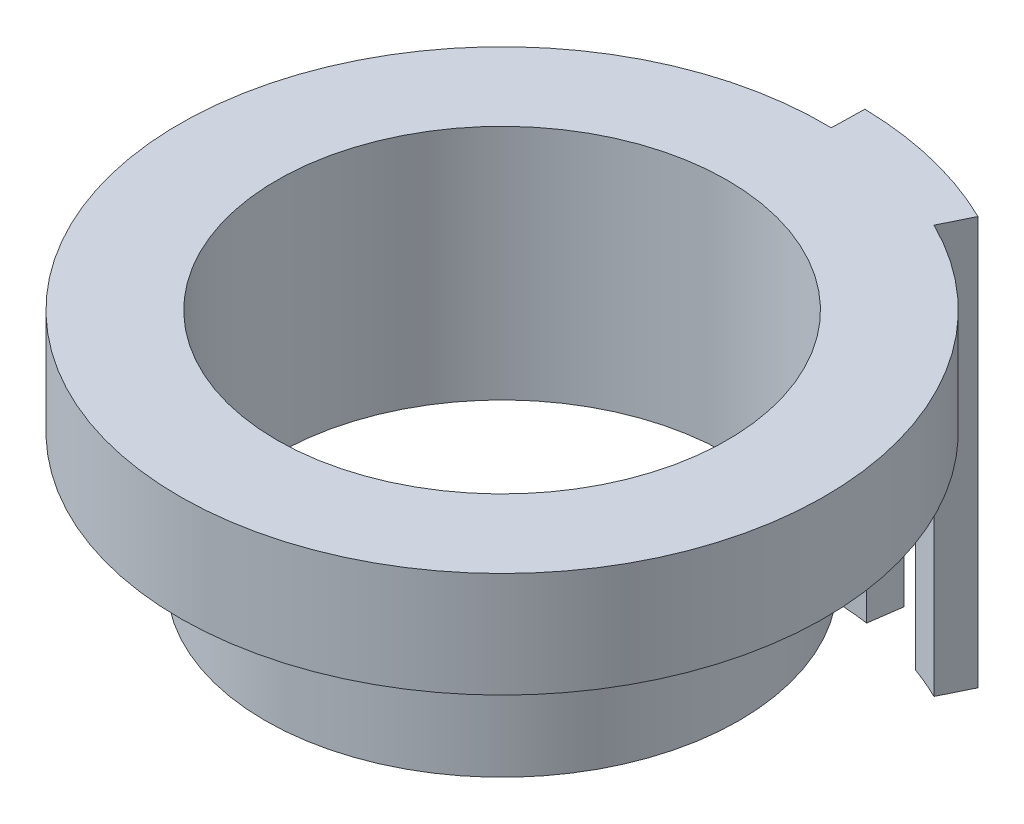
ISO-10303-21;
HEADER;
FILE_DESCRIPTION(('STEP AP214'),'2;1');
FILE_NAME('part.step','',(''),(''),'','','');
FILE_SCHEMA(('AUTOMOTIVE_DESIGN { 1 0 10303 214 1 1 1 1 }'));
ENDSEC;
DATA;
#1=APPLICATION_CONTEXT('core data for automotive mechanical design processes');
#2=APPLICATION_PROTOCOL_DEFINITION('international standard','automotive_design',2000,#1);
#3=PRODUCT_CONTEXT('',#1,'mechanical');
#4=PRODUCT('Part','Part','',(#3));
#5=PRODUCT_RELATED_PRODUCT_CATEGORY('part','',(#4));
#6=PRODUCT_DEFINITION_FORMATION('','',#4);
#7=PRODUCT_DEFINITION_CONTEXT('part definition',#1,'design');
#8=PRODUCT_DEFINITION('design','',#6,#7);
#9=PRODUCT_DEFINITION_SHAPE('','',#8);
#10=(LENGTH_UNIT() NAMED_UNIT(*) SI_UNIT(.MILLI.,.METRE.));
#11=(NAMED_UNIT(*) PLANE_ANGLE_UNIT() SI_UNIT($,.RADIAN.));
#12=(NAMED_UNIT(*) SI_UNIT($,.STERADIAN.) SOLID_ANGLE_UNIT());
#13=UNCERTAINTY_MEASURE_WITH_UNIT(LENGTH_MEASURE(1.E-05),#10,'distance_accuracy_value','');
#14=(GEOMETRIC_REPRESENTATION_CONTEXT(3) GLOBAL_UNCERTAINTY_ASSIGNED_CONTEXT((#13)) GLOBAL_UNIT_ASSIGNED_CONTEXT((#10,
#11,#12)) REPRESENTATION_CONTEXT('',''));
#15=CARTESIAN_POINT('',(0.,0.,0.));
#16=DIRECTION('',(0.,0.,1.));
#17=DIRECTION('',(1.,0.,0.));
#18=AXIS2_PLACEMENT_3D('',#15,#16,#17);
#19=CARTESIAN_POINT('',(0.,8.,0.));
#20=DIRECTION('',(0.,-1.,0.));
#21=DIRECTION('',(0.,0.,-1.));
#22=AXIS2_PLACEMENT_3D('',#19,#20,#21);
#23=CYLINDRICAL_SURFACE('',#22,24.5);
#24=DIRECTION('',(0.,1.,0.));
#25=VECTOR('',#24,1.);
#26=CARTESIAN_POINT('',(8.39662069758259,-23.,-23.0162282066573));
#27=LINE('',#26,#25);
#28=CARTESIAN_POINT('',(8.39662069758259,0.,-23.0162282066573));
#29=VERTEX_POINT('',#28);
#30=CARTESIAN_POINT('',(8.39662069758259,4.,-23.0162282066573));
#31=VERTEX_POINT('',#30);
#32=EDGE_CURVE('E155',#29,#31,#27,.T.);
#33=ORIENTED_EDGE('',*,*,#32,.F.);
#34=CARTESIAN_POINT('',(0.,0.,0.));
#35=DIRECTION('',(0.,1.,0.));
#36=DIRECTION('',(0.,0.,1.));
#37=AXIS2_PLACEMENT_3D('',#34,#35,#36);
#38=CIRCLE('',#37,24.5);
#39=CARTESIAN_POINT('',(3.42779146691868,0.,-24.2590240046734));
#40=VERTEX_POINT('',#39);
#41=EDGE_CURVE('E231',#29,#40,#38,.T.);
#42=ORIENTED_EDGE('',*,*,#41,.T.);
#43=DIRECTION('',(0.,1.,0.));
#44=VECTOR('',#43,1.);
#45=CARTESIAN_POINT('',(3.42779146691868,-23.,-24.2590240046734));
#46=LINE('',#45,#44);
#47=CARTESIAN_POINT('',(3.42779146691868,4.,-24.2590240046734));
#48=VERTEX_POINT('',#47);
#49=EDGE_CURVE('E189',#40,#48,#46,.T.);
#50=ORIENTED_EDGE('',*,*,#49,.T.);
#51=CARTESIAN_POINT('',(0.,4.,0.));
#52=DIRECTION('',(0.,-1.,0.));
#53=DIRECTION('',(0.,0.,-1.));
#54=AXIS2_PLACEMENT_3D('',#51,#52,#53);
#55=CIRCLE('',#54,24.5);
#56=EDGE_CURVE('E198',#48,#31,#55,.T.);
#57=ORIENTED_EDGE('',*,*,#56,.T.);
#58=EDGE_LOOP('',(#33,#42,#50,#57));
#59=FACE_BOUND('',#58,.T.);
#60=ADVANCED_FACE('F47',(#59),#23,.T.);
#61=CARTESIAN_POINT('',(0.506368993526455,0.,-24.4947665929356));
#62=VERTEX_POINT('',#61);
#63=CARTESIAN_POINT('',(10.8108618411976,0.,-21.9857969209792));
#64=VERTEX_POINT('',#63);
#65=EDGE_CURVE('E241',#62,#64,#38,.T.);
#66=ORIENTED_EDGE('',*,*,#65,.T.);
#67=DIRECTION('',(0.,1.,0.));
#68=VECTOR('',#67,1.);
#69=CARTESIAN_POINT('',(10.8108618411976,4.,-21.9857969209792));
#70=LINE('',#69,#68);
#71=CARTESIAN_POINT('',(10.8108618411976,8.,-21.9857969209792));
#72=VERTEX_POINT('',#71);
#73=EDGE_CURVE('E214',#64,#72,#70,.T.);
#74=ORIENTED_EDGE('',*,*,#73,.T.);
#75=CARTESIAN_POINT('',(0.,8.,0.));
#76=DIRECTION('',(0.,1.,0.));
#77=DIRECTION('',(0.,0.,1.));
#78=AXIS2_PLACEMENT_3D('',#75,#76,#77);
#79=CIRCLE('',#78,24.5);
#80=CARTESIAN_POINT('',(0.506368993526455,8.,-24.4947665929356));
#81=VERTEX_POINT('',#80);
#82=EDGE_CURVE('E11',#81,#72,#79,.T.);
#83=ORIENTED_EDGE('',*,*,#82,.F.);
#84=DIRECTION('',(0.,1.,0.));
#85=VECTOR('',#84,1.);
#86=CARTESIAN_POINT('',(0.506368993526455,4.,-24.4947665929356));
#87=LINE('',#86,#85);
#88=EDGE_CURVE('E218',#62,#81,#87,.T.);
#89=ORIENTED_EDGE('',*,*,#88,.F.);
#90=EDGE_LOOP('',(#66,#74,#83,#89));
#91=FACE_BOUND('',#90,.T.);
#92=ADVANCED_FACE('F263',(#91),#23,.T.);
#93=CARTESIAN_POINT('',(0.,4.,0.));
#94=DIRECTION('',(0.,-1.,0.));
#95=DIRECTION('',(0.,0.,-1.));
#96=AXIS2_PLACEMENT_3D('',#93,#94,#95);
#97=PLANE('',#96);
#98=CARTESIAN_POINT('',(0.,4.,0.));
#99=DIRECTION('',(0.,1.,0.));
#100=DIRECTION('',(0.,0.,-1.));
#101=AXIS2_PLACEMENT_3D('',#98,#99,#100);
#102=CIRCLE('',#101,27.);
#103=CARTESIAN_POINT('',(9.25341872794816,4.,-25.3648229216223));
#104=VERTEX_POINT('',#103);
#105=CARTESIAN_POINT('',(3.77756610640018,4.,-26.7344346173952));
#106=VERTEX_POINT('',#105);
#107=EDGE_CURVE('E195',#104,#106,#102,.T.);
#108=ORIENTED_EDGE('',*,*,#107,.F.);
#109=DIRECTION('',(0.342719212146228,0.,-0.939437885986013));
#110=VECTOR('',#109,1.);
#111=CARTESIAN_POINT('',(0.,4.,0.));
#112=LINE('',#111,#110);
#113=EDGE_CURVE('E149',#31,#104,#112,.T.);
#114=ORIENTED_EDGE('',*,*,#113,.F.);
#115=ORIENTED_EDGE('',*,*,#56,.F.);
#116=DIRECTION('',(0.1399098557926,0.,-0.99016424508871));
#117=VECTOR('',#116,1.);
#118=CARTESIAN_POINT('',(0.,4.,0.));
#119=LINE('',#118,#117);
#120=EDGE_CURVE('E159',#48,#106,#119,.T.);
#121=ORIENTED_EDGE('',*,*,#120,.T.);
#122=EDGE_LOOP('',(#108,#114,#115,#121));
#123=FACE_BOUND('',#122,.T.);
#124=ADVANCED_FACE('F276',(#123),#97,.T.);
#125=CARTESIAN_POINT('',(0.,8.,0.));
#126=DIRECTION('',(0.,-1.,0.));
#127=DIRECTION('',(0.,0.,-1.));
#128=AXIS2_PLACEMENT_3D('',#125,#126,#127);
#129=CYLINDRICAL_SURFACE('',#128,17.1);
#130=CARTESIAN_POINT('',(0.,8.,0.));
#131=DIRECTION('',(0.,1.,0.));
#132=DIRECTION('',(0.,0.,1.));
#133=AXIS2_PLACEMENT_3D('',#130,#131,#132);
#134=CIRCLE('',#133,17.1);
#135=CARTESIAN_POINT('',(0.,8.,17.1));
#136=VERTEX_POINT('',#135);
#137=EDGE_CURVE('E57',#136,#136,#134,.T.);
#138=ORIENTED_EDGE('',*,*,#137,.T.);
#139=EDGE_LOOP('',(#138));
#140=FACE_BOUND('',#139,.T.);
#141=CARTESIAN_POINT('',(0.,-10.,0.));
#142=DIRECTION('',(0.,1.,0.));
#143=DIRECTION('',(0.,0.,1.));
#144=AXIS2_PLACEMENT_3D('',#141,#142,#143);
#145=CIRCLE('',#144,17.1);
#146=CARTESIAN_POINT('',(0.,-10.,17.1));
#147=VERTEX_POINT('',#146);
#148=EDGE_CURVE('E223',#147,#147,#145,.T.);
#149=ORIENTED_EDGE('',*,*,#148,.F.);
#150=EDGE_LOOP('',(#149));
#151=FACE_BOUND('',#150,.T.);
#152=ADVANCED_FACE('F49',(#140,#151),#129,.F.);
#153=CARTESIAN_POINT('',(0.,8.,0.));
#154=DIRECTION('',(0.,1.,0.));
#155=DIRECTION('',(0.,0.,1.));
#156=AXIS2_PLACEMENT_3D('',#153,#154,#155);
#157=PLANE('',#156);
#158=ORIENTED_EDGE('',*,*,#137,.F.);
#159=EDGE_LOOP('',(#158));
#160=FACE_BOUND('',#159,.T.);
#161=ORIENTED_EDGE('',*,*,#82,.T.);
#162=DIRECTION('',(0.441259666987657,0.,-0.897379466162416));
#163=VECTOR('',#162,1.);
#164=CARTESIAN_POINT('',(11.9140110086667,8.,-24.2292455863852));
#165=LINE('',#164,#163);
#166=CARTESIAN_POINT('',(11.9140110086667,8.,-24.2292455863852));
#167=VERTEX_POINT('',#166);
#168=EDGE_CURVE('E199',#72,#167,#165,.T.);
#169=ORIENTED_EDGE('',*,*,#168,.T.);
#170=CARTESIAN_POINT('',(0.,8.,0.));
#171=DIRECTION('',(0.,1.,0.));
#172=DIRECTION('',(0.,0.,-1.));
#173=AXIS2_PLACEMENT_3D('',#170,#171,#172);
#174=CIRCLE('',#173,27.);
#175=CARTESIAN_POINT('',(0.558039298988338,8.,-26.9942325718066));
#176=VERTEX_POINT('',#175);
#177=EDGE_CURVE('E194',#167,#176,#174,.T.);
#178=ORIENTED_EDGE('',*,*,#177,.T.);
#179=DIRECTION('',(-0.0206681221847532,0.,0.999786391548393));
#180=VECTOR('',#179,1.);
#181=CARTESIAN_POINT('',(0.558039298988338,8.,-26.9942325718066));
#182=LINE('',#181,#180);
#183=EDGE_CURVE('E63',#176,#81,#182,.T.);
#184=ORIENTED_EDGE('',*,*,#183,.T.);
#185=EDGE_LOOP('',(#161,#169,#178,#184));
#186=FACE_BOUND('',#185,.T.);
#187=ADVANCED_FACE('F288',(#160,#186),#157,.T.);
#188=CARTESIAN_POINT('',(0.,0.,0.));
#189=DIRECTION('',(0.,1.,0.));
#190=DIRECTION('',(0.,0.,1.));
#191=AXIS2_PLACEMENT_3D('',#188,#189,#190);
#192=PLANE('',#191);
#193=CARTESIAN_POINT('',(0.,0.,0.));
#194=DIRECTION('',(0.,1.,0.));
#195=DIRECTION('',(0.,0.,1.));
#196=AXIS2_PLACEMENT_3D('',#193,#194,#195);
#197=CIRCLE('',#196,18.);
#198=CARTESIAN_POINT('',(0.,0.,18.));
#199=VERTEX_POINT('',#198);
#200=EDGE_CURVE('E213',#199,#199,#197,.T.);
#201=ORIENTED_EDGE('',*,*,#200,.T.);
#202=EDGE_LOOP('',(#201));
#203=FACE_BOUND('',#202,.T.);
#204=EDGE_CURVE('E51',#40,#62,#38,.T.);
#205=ORIENTED_EDGE('',*,*,#204,.F.);
#206=ORIENTED_EDGE('',*,*,#41,.F.);
#207=CARTESIAN_POINT('',(0.,0.,0.));
#208=DIRECTION('',(0.,1.,0.));
#209=DIRECTION('',(0.,0.,1.));
#210=AXIS2_PLACEMENT_3D('',#207,#208,#209);
#211=CIRCLE('',#210,24.5);
#212=EDGE_CURVE('E153',#64,#29,#211,.T.);
#213=ORIENTED_EDGE('',*,*,#212,.F.);
#214=ORIENTED_EDGE('',*,*,#65,.F.);
#215=EDGE_LOOP('',(#205,#206,#213,#214));
#216=FACE_BOUND('',#215,.T.);
#217=ADVANCED_FACE('F261',(#203,#216),#192,.F.);
#218=CARTESIAN_POINT('',(0.,-10.,0.));
#219=DIRECTION('',(0.,1.,0.));
#220=DIRECTION('',(0.,0.,1.));
#221=AXIS2_PLACEMENT_3D('',#218,#219,#220);
#222=CYLINDRICAL_SURFACE('',#221,18.);
#223=CARTESIAN_POINT('',(0.,-10.,0.));
#224=DIRECTION('',(0.,1.,0.));
#225=DIRECTION('',(0.,0.,1.));
#226=AXIS2_PLACEMENT_3D('',#223,#224,#225);
#227=CIRCLE('',#226,18.);
#228=CARTESIAN_POINT('',(0.,-10.,18.));
#229=VERTEX_POINT('',#228);
#230=EDGE_CURVE('E227',#229,#229,#227,.T.);
#231=ORIENTED_EDGE('',*,*,#230,.T.);
#232=EDGE_LOOP('',(#231));
#233=FACE_BOUND('',#232,.T.);
#234=ORIENTED_EDGE('',*,*,#200,.F.);
#235=EDGE_LOOP('',(#234));
#236=FACE_BOUND('',#235,.T.);
#237=ADVANCED_FACE('F297',(#233,#236),#222,.T.);
#238=CARTESIAN_POINT('',(0.,-10.,0.));
#239=DIRECTION('',(0.,1.,0.));
#240=DIRECTION('',(0.,0.,1.));
#241=AXIS2_PLACEMENT_3D('',#238,#239,#240);
#242=PLANE('',#241);
#243=ORIENTED_EDGE('',*,*,#148,.T.);
#244=EDGE_LOOP('',(#243));
#245=FACE_BOUND('',#244,.T.);
#246=ORIENTED_EDGE('',*,*,#230,.F.);
#247=EDGE_LOOP('',(#246));
#248=FACE_BOUND('',#247,.T.);
#249=ADVANCED_FACE('F320',(#245,#248),#242,.F.);
#250=CARTESIAN_POINT('',(0.,4.,0.));
#251=DIRECTION('',(0.,1.,0.));
#252=DIRECTION('',(0.,0.,1.));
#253=AXIS2_PLACEMENT_3D('',#250,#251,#252);
#254=CYLINDRICAL_SURFACE('',#253,27.);
#255=ORIENTED_EDGE('',*,*,#177,.F.);
#256=DIRECTION('',(0.,1.,0.));
#257=VECTOR('',#256,1.);
#258=CARTESIAN_POINT('',(11.9140110086667,4.,-24.2292455863852));
#259=LINE('',#258,#257);
#260=CARTESIAN_POINT('',(11.9140110086667,-23.,-24.2292455863852));
#261=VERTEX_POINT('',#260);
#262=EDGE_CURVE('E71',#261,#167,#259,.T.);
#263=ORIENTED_EDGE('',*,*,#262,.F.);
#264=CARTESIAN_POINT('',(0.,-23.,0.));
#265=DIRECTION('',(0.,-1.,0.));
#266=DIRECTION('',(0.,0.,-1.));
#267=AXIS2_PLACEMENT_3D('',#264,#265,#266);
#268=CIRCLE('',#267,27.);
#269=CARTESIAN_POINT('',(9.25341872794816,-23.,-25.3648229216223));
#270=VERTEX_POINT('',#269);
#271=EDGE_CURVE('E139',#270,#261,#268,.T.);
#272=ORIENTED_EDGE('',*,*,#271,.F.);
#273=DIRECTION('',(0.,1.,0.));
#274=VECTOR('',#273,1.);
#275=CARTESIAN_POINT('',(9.25341872794816,-23.,-25.3648229216223));
#276=LINE('',#275,#274);
#277=EDGE_CURVE('E134',#270,#104,#276,.T.);
#278=ORIENTED_EDGE('',*,*,#277,.T.);
#279=ORIENTED_EDGE('',*,*,#107,.T.);
#280=DIRECTION('',(0.,1.,0.));
#281=VECTOR('',#280,1.);
#282=CARTESIAN_POINT('',(3.77756610640018,-23.,-26.7344346173952));
#283=LINE('',#282,#281);
#284=CARTESIAN_POINT('',(3.77756610640018,-23.,-26.7344346173952));
#285=VERTEX_POINT('',#284);
#286=EDGE_CURVE('E178',#285,#106,#283,.T.);
#287=ORIENTED_EDGE('',*,*,#286,.F.);
#288=CARTESIAN_POINT('',(0.,-23.,0.));
#289=DIRECTION('',(0.,-1.,0.));
#290=DIRECTION('',(0.,0.,-1.));
#291=AXIS2_PLACEMENT_3D('',#288,#289,#290);
#292=CIRCLE('',#291,27.);
#293=CARTESIAN_POINT('',(0.558039298988338,-23.,-26.9942325718066));
#294=VERTEX_POINT('',#293);
#295=EDGE_CURVE('E175',#294,#285,#292,.T.);
#296=ORIENTED_EDGE('',*,*,#295,.F.);
#297=DIRECTION('',(0.,1.,0.));
#298=VECTOR('',#297,1.);
#299=CARTESIAN_POINT('',(0.558039298988338,4.,-26.9942325718066));
#300=LINE('',#299,#298);
#301=EDGE_CURVE('E203',#294,#176,#300,.T.);
#302=ORIENTED_EDGE('',*,*,#301,.T.);
#303=EDGE_LOOP('',(#255,#263,#272,#278,#279,#287,#296,#302));
#304=FACE_BOUND('',#303,.T.);
#305=ADVANCED_FACE('F273',(#304),#254,.T.);
#306=CARTESIAN_POINT('',(11.9140110086667,4.,-24.2292455863852));
#307=DIRECTION('',(0.897379466162416,0.,0.441259666987656));
#308=DIRECTION('',(0.441259666987657,0.,-0.897379466162416));
#309=AXIS2_PLACEMENT_3D('',#306,#307,#308);
#310=PLANE('',#309);
#311=ORIENTED_EDGE('',*,*,#168,.F.);
#312=ORIENTED_EDGE('',*,*,#73,.F.);
#313=DIRECTION('',(0.,1.,0.));
#314=VECTOR('',#313,1.);
#315=CARTESIAN_POINT('',(10.8108618411976,-23.,-21.9857969209792));
#316=LINE('',#315,#314);
#317=CARTESIAN_POINT('',(10.8108618411976,-23.,-21.9857969209792));
#318=VERTEX_POINT('',#317);
#319=EDGE_CURVE('E282',#318,#64,#316,.T.);
#320=ORIENTED_EDGE('',*,*,#319,.F.);
#321=DIRECTION('',(-0.441259666987656,0.,0.897379466162416));
#322=VECTOR('',#321,1.);
#323=CARTESIAN_POINT('',(0.,-23.,0.));
#324=LINE('',#323,#322);
#325=EDGE_CURVE('E144',#261,#318,#324,.T.);
#326=ORIENTED_EDGE('',*,*,#325,.F.);
#327=ORIENTED_EDGE('',*,*,#262,.T.);
#328=EDGE_LOOP('',(#311,#312,#320,#326,#327));
#329=FACE_BOUND('',#328,.T.);
#330=ADVANCED_FACE('F287',(#329),#310,.T.);
#331=CARTESIAN_POINT('',(0.558039298988338,4.,-26.9942325718066));
#332=DIRECTION('',(-0.999786391548393,0.,-0.0206681221847532));
#333=DIRECTION('',(-0.0206681221847532,0.,0.999786391548393));
#334=AXIS2_PLACEMENT_3D('',#331,#332,#333);
#335=PLANE('',#334);
#336=ORIENTED_EDGE('',*,*,#183,.F.);
#337=ORIENTED_EDGE('',*,*,#301,.F.);
#338=DIRECTION('',(0.0206681221847533,0.,-0.999786391548393));
#339=VECTOR('',#338,1.);
#340=CARTESIAN_POINT('',(0.,-23.,0.));
#341=LINE('',#340,#339);
#342=CARTESIAN_POINT('',(0.506368993526455,-23.,-24.4947665929356));
#343=VERTEX_POINT('',#342);
#344=EDGE_CURVE('E171',#343,#294,#341,.T.);
#345=ORIENTED_EDGE('',*,*,#344,.F.);
#346=DIRECTION('',(0.,1.,0.));
#347=VECTOR('',#346,1.);
#348=CARTESIAN_POINT('',(0.506368993526455,-23.,-24.4947665929356));
#349=LINE('',#348,#347);
#350=EDGE_CURVE('E185',#343,#62,#349,.T.);
#351=ORIENTED_EDGE('',*,*,#350,.T.);
#352=ORIENTED_EDGE('',*,*,#88,.T.);
#353=EDGE_LOOP('',(#336,#337,#345,#351,#352));
#354=FACE_BOUND('',#353,.T.);
#355=ADVANCED_FACE('F266',(#354),#335,.T.);
#356=CARTESIAN_POINT('',(0.,-23.,0.));
#357=DIRECTION('',(0.,1.,0.));
#358=DIRECTION('',(0.,0.,1.));
#359=AXIS2_PLACEMENT_3D('',#356,#357,#358);
#360=CYLINDRICAL_SURFACE('',#359,24.5);
#361=CARTESIAN_POINT('',(3.42779146691868,-23.,-24.2590240046734));
#362=VERTEX_POINT('',#361);
#363=EDGE_CURVE('E190',#362,#40,#46,.T.);
#364=ORIENTED_EDGE('',*,*,#363,.T.);
#365=ORIENTED_EDGE('',*,*,#204,.T.);
#366=ORIENTED_EDGE('',*,*,#350,.F.);
#367=CARTESIAN_POINT('',(0.,-23.,0.));
#368=DIRECTION('',(0.,-1.,0.));
#369=DIRECTION('',(0.,0.,-1.));
#370=AXIS2_PLACEMENT_3D('',#367,#368,#369);
#371=CIRCLE('',#370,24.5);
#372=EDGE_CURVE('E168',#362,#343,#371,.F.);
#373=ORIENTED_EDGE('',*,*,#372,.F.);
#374=EDGE_LOOP('',(#364,#365,#366,#373));
#375=FACE_BOUND('',#374,.T.);
#376=ADVANCED_FACE('F258',(#375),#360,.F.);
#377=CARTESIAN_POINT('',(0.,-23.,0.));
#378=DIRECTION('',(0.99016424508871,0.,0.1399098557926));
#379=DIRECTION('',(0.1399098557926,0.,-0.99016424508871));
#380=AXIS2_PLACEMENT_3D('',#377,#378,#379);
#381=PLANE('',#380);
#382=ORIENTED_EDGE('',*,*,#120,.F.);
#383=ORIENTED_EDGE('',*,*,#49,.F.);
#384=ORIENTED_EDGE('',*,*,#363,.F.);
#385=DIRECTION('',(0.1399098557926,0.,-0.99016424508871));
#386=VECTOR('',#385,1.);
#387=CARTESIAN_POINT('',(0.,-23.,0.));
#388=LINE('',#387,#386);
#389=EDGE_CURVE('E164',#362,#285,#388,.T.);
#390=ORIENTED_EDGE('',*,*,#389,.T.);
#391=ORIENTED_EDGE('',*,*,#286,.T.);
#392=EDGE_LOOP('',(#382,#383,#384,#390,#391));
#393=FACE_BOUND('',#392,.T.);
#394=ADVANCED_FACE('F255',(#393),#381,.T.);
#395=CARTESIAN_POINT('',(0.,-23.,0.));
#396=DIRECTION('',(0.,-1.,0.));
#397=DIRECTION('',(0.,0.,-1.));
#398=AXIS2_PLACEMENT_3D('',#395,#396,#397);
#399=PLANE('',#398);
#400=ORIENTED_EDGE('',*,*,#389,.F.);
#401=ORIENTED_EDGE('',*,*,#372,.T.);
#402=ORIENTED_EDGE('',*,*,#344,.T.);
#403=ORIENTED_EDGE('',*,*,#295,.T.);
#404=EDGE_LOOP('',(#400,#401,#402,#403));
#405=FACE_BOUND('',#404,.T.);
#406=ADVANCED_FACE('F270',(#405),#399,.T.);
#407=CARTESIAN_POINT('',(0.,-23.,0.));
#408=DIRECTION('',(0.,1.,0.));
#409=DIRECTION('',(0.,0.,1.));
#410=AXIS2_PLACEMENT_3D('',#407,#408,#409);
#411=CYLINDRICAL_SURFACE('',#410,24.5);
#412=ORIENTED_EDGE('',*,*,#319,.T.);
#413=ORIENTED_EDGE('',*,*,#212,.T.);
#414=CARTESIAN_POINT('',(8.39662069758259,-23.,-23.0162282066573));
#415=VERTEX_POINT('',#414);
#416=EDGE_CURVE('E131',#415,#29,#27,.T.);
#417=ORIENTED_EDGE('',*,*,#416,.F.);
#418=CARTESIAN_POINT('',(0.,-23.,0.));
#419=DIRECTION('',(0.,-1.,0.));
#420=DIRECTION('',(0.,0.,-1.));
#421=AXIS2_PLACEMENT_3D('',#418,#419,#420);
#422=CIRCLE('',#421,24.5);
#423=EDGE_CURVE('E140',#318,#415,#422,.F.);
#424=ORIENTED_EDGE('',*,*,#423,.F.);
#425=EDGE_LOOP('',(#412,#413,#417,#424));
#426=FACE_BOUND('',#425,.T.);
#427=ADVANCED_FACE('F151',(#426),#411,.F.);
#428=CARTESIAN_POINT('',(0.,-23.,0.));
#429=DIRECTION('',(0.939437885986013,0.,0.342719212146228));
#430=DIRECTION('',(0.342719212146228,0.,-0.939437885986013));
#431=AXIS2_PLACEMENT_3D('',#428,#429,#430);
#432=PLANE('',#431);
#433=ORIENTED_EDGE('',*,*,#113,.T.);
#434=ORIENTED_EDGE('',*,*,#277,.F.);
#435=DIRECTION('',(0.342719212146228,0.,-0.939437885986013));
#436=VECTOR('',#435,1.);
#437=CARTESIAN_POINT('',(0.,-23.,0.));
#438=LINE('',#437,#436);
#439=EDGE_CURVE('E127',#415,#270,#438,.T.);
#440=ORIENTED_EDGE('',*,*,#439,.F.);
#441=ORIENTED_EDGE('',*,*,#416,.T.);
#442=ORIENTED_EDGE('',*,*,#32,.T.);
#443=EDGE_LOOP('',(#433,#434,#440,#441,#442));
#444=FACE_BOUND('',#443,.T.);
#445=ADVANCED_FACE('F129',(#444),#432,.F.);
#446=CARTESIAN_POINT('',(0.,-23.,0.));
#447=DIRECTION('',(0.,-1.,0.));
#448=DIRECTION('',(0.,0.,-1.));
#449=AXIS2_PLACEMENT_3D('',#446,#447,#448);
#450=PLANE('',#449);
#451=ORIENTED_EDGE('',*,*,#423,.T.);
#452=ORIENTED_EDGE('',*,*,#439,.T.);
#453=ORIENTED_EDGE('',*,*,#271,.T.);
#454=ORIENTED_EDGE('',*,*,#325,.T.);
#455=EDGE_LOOP('',(#451,#452,#453,#454));
#456=FACE_BOUND('',#455,.T.);
#457=ADVANCED_FACE('F143',(#456),#450,.T.);
#458=CLOSED_SHELL('',(#60,#92,#124,#152,#187,#217,#237,#249,#305,#330,#355,#376,#394,#406,#427,
#445,#457));
#459=MANIFOLD_SOLID_BREP('B2',#458);
#460=ADVANCED_BREP_SHAPE_REPRESENTATION('',(#18,#459),#14);
#461=SHAPE_DEFINITION_REPRESENTATION(#9,#460);
ENDSEC;
END-ISO-10303-21;
